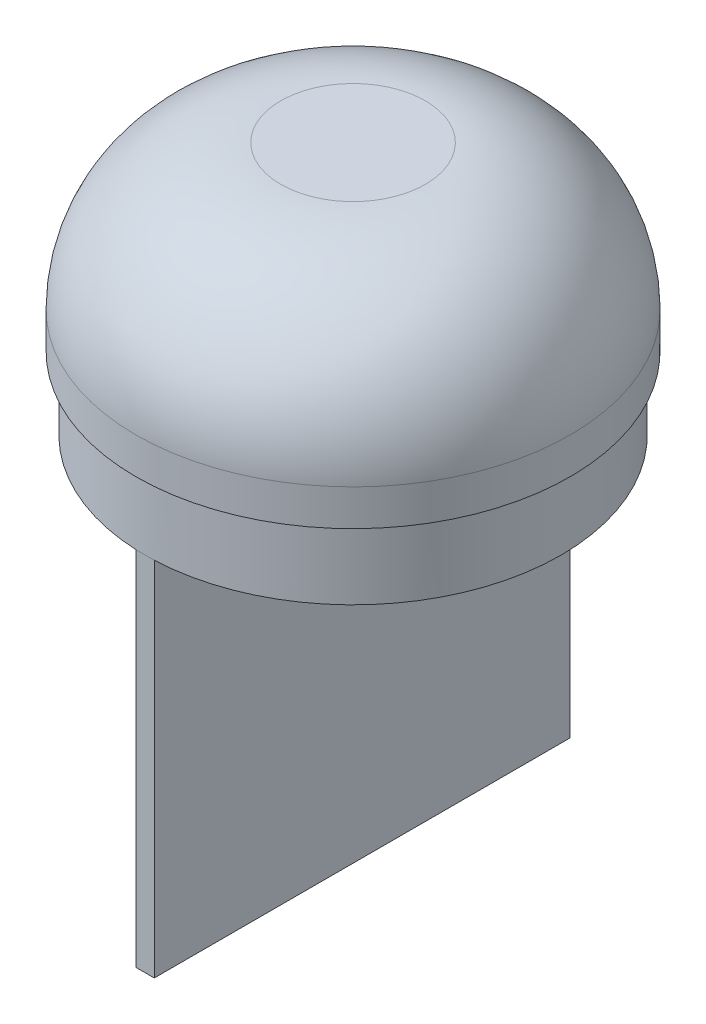
ISO-10303-21;
HEADER;
FILE_DESCRIPTION(('STEP AP214'),'2;1');
FILE_NAME('part.step','',(''),(''),'','','');
FILE_SCHEMA(('AUTOMOTIVE_DESIGN { 1 0 10303 214 1 1 1 1 }'));
ENDSEC;
DATA;
#1=APPLICATION_CONTEXT('core data for automotive mechanical design processes');
#2=APPLICATION_PROTOCOL_DEFINITION('international standard','automotive_design',2000,#1);
#3=PRODUCT_CONTEXT('',#1,'mechanical');
#4=PRODUCT('Part','Part','',(#3));
#5=PRODUCT_RELATED_PRODUCT_CATEGORY('part','',(#4));
#6=PRODUCT_DEFINITION_FORMATION('','',#4);
#7=PRODUCT_DEFINITION_CONTEXT('part definition',#1,'design');
#8=PRODUCT_DEFINITION('design','',#6,#7);
#9=PRODUCT_DEFINITION_SHAPE('','',#8);
#10=(LENGTH_UNIT() NAMED_UNIT(*) SI_UNIT(.MILLI.,.METRE.));
#11=(NAMED_UNIT(*) PLANE_ANGLE_UNIT() SI_UNIT($,.RADIAN.));
#12=(NAMED_UNIT(*) SI_UNIT($,.STERADIAN.) SOLID_ANGLE_UNIT());
#13=UNCERTAINTY_MEASURE_WITH_UNIT(LENGTH_MEASURE(1.E-05),#10,'distance_accuracy_value','');
#14=(GEOMETRIC_REPRESENTATION_CONTEXT(3) GLOBAL_UNCERTAINTY_ASSIGNED_CONTEXT((#13)) GLOBAL_UNIT_ASSIGNED_CONTEXT((#10,
#11,#12)) REPRESENTATION_CONTEXT('',''));
#15=CARTESIAN_POINT('',(0.,0.,0.));
#16=DIRECTION('',(0.,0.,1.));
#17=DIRECTION('',(1.,0.,0.));
#18=AXIS2_PLACEMENT_3D('',#15,#16,#17);
#19=CARTESIAN_POINT('',(0.,0.,0.));
#20=DIRECTION('',(0.,1.,0.));
#21=DIRECTION('',(0.,0.,1.));
#22=AXIS2_PLACEMENT_3D('',#19,#20,#21);
#23=PLANE('',#22);
#24=DIRECTION('',(0.,0.,-1.));
#25=VECTOR('',#24,1.);
#26=CARTESIAN_POINT('',(-0.25,0.,-5.74456264653803));
#27=LINE('',#26,#25);
#28=CARTESIAN_POINT('',(-0.249996391122275,0.,5.74464376945105));
#29=VERTEX_POINT('',#28);
#30=CARTESIAN_POINT('',(-0.249996839826753,0.,-5.74463390650864));
#31=VERTEX_POINT('',#30);
#32=EDGE_CURVE('E52',#29,#31,#27,.T.);
#33=ORIENTED_EDGE('',*,*,#32,.F.);
#34=CARTESIAN_POINT('',(0.,0.,0.));
#35=DIRECTION('',(0.,1.,0.));
#36=DIRECTION('',(-0.0434771856404905,0.,-0.999054420103721));
#37=AXIS2_PLACEMENT_3D('',#34,#35,#36);
#38=CIRCLE('',#37,5.75);
#39=EDGE_CURVE('E55',#31,#29,#38,.T.);
#40=ORIENTED_EDGE('',*,*,#39,.F.);
#41=EDGE_LOOP('',(#33,#40));
#42=FACE_BOUND('',#41,.T.);
#43=ADVANCED_FACE('F35',(#42),#23,.F.);
#44=DIRECTION('',(0.,0.,1.));
#45=VECTOR('',#44,1.);
#46=CARTESIAN_POINT('',(0.25,0.,-5.74456264653803));
#47=LINE('',#46,#45);
#48=CARTESIAN_POINT('',(0.249995801676083,0.,-5.74465685199978));
#49=VERTEX_POINT('',#48);
#50=CARTESIAN_POINT('',(0.249996244692889,0.,5.74464699592917));
#51=VERTEX_POINT('',#50);
#52=EDGE_CURVE('E165',#49,#51,#47,.T.);
#53=ORIENTED_EDGE('',*,*,#52,.F.);
#54=CARTESIAN_POINT('',(0.,0.,0.));
#55=DIRECTION('',(0.,1.,0.));
#56=DIRECTION('',(0.0434769867514798,0.,0.99905442875902));
#57=AXIS2_PLACEMENT_3D('',#54,#55,#56);
#58=CIRCLE('',#57,5.75);
#59=EDGE_CURVE('E119',#51,#49,#58,.T.);
#60=ORIENTED_EDGE('',*,*,#59,.F.);
#61=EDGE_LOOP('',(#53,#60));
#62=FACE_BOUND('',#61,.T.);
#63=ADVANCED_FACE('F140',(#62),#23,.F.);
#64=CARTESIAN_POINT('',(0.,2.,0.));
#65=DIRECTION('',(0.,-1.,0.));
#66=DIRECTION('',(0.,0.,-1.));
#67=AXIS2_PLACEMENT_3D('',#64,#65,#66);
#68=CYLINDRICAL_SURFACE('',#67,5.75);
#69=CARTESIAN_POINT('',(0.,2.,0.));
#70=DIRECTION('',(0.,1.,0.));
#71=DIRECTION('',(0.,0.,1.));
#72=AXIS2_PLACEMENT_3D('',#69,#70,#71);
#73=CIRCLE('',#72,5.75);
#74=CARTESIAN_POINT('',(0.,2.,5.75));
#75=VERTEX_POINT('',#74);
#76=EDGE_CURVE('E116',#75,#75,#73,.T.);
#77=ORIENTED_EDGE('',*,*,#76,.F.);
#78=EDGE_LOOP('',(#77));
#79=FACE_BOUND('',#78,.T.);
#80=ORIENTED_EDGE('',*,*,#59,.T.);
#81=CARTESIAN_POINT('',(-0.25,0.,-5.74456264653803));
#82=DIRECTION('',(1.,0.,0.));
#83=VECTOR('',#82,1.);
#84=LINE('',#81,#83);
#85=EDGE_CURVE('E158',#31,#49,#84,.T.);
#86=ORIENTED_EDGE('',*,*,#85,.F.);
#87=ORIENTED_EDGE('',*,*,#39,.T.);
#88=CARTESIAN_POINT('',(0.25,0.,5.74456264653803));
#89=DIRECTION('',(-1.,0.,0.));
#90=VECTOR('',#89,1.);
#91=LINE('',#88,#90);
#92=EDGE_CURVE('E97',#51,#29,#91,.T.);
#93=ORIENTED_EDGE('',*,*,#92,.F.);
#94=EDGE_LOOP('',(#80,#86,#87,#93));
#95=FACE_BOUND('',#94,.T.);
#96=ADVANCED_FACE('F130',(#79,#95),#68,.T.);
#97=CARTESIAN_POINT('',(0.,7.,0.));
#98=DIRECTION('',(0.,-1.,0.));
#99=DIRECTION('',(0.,0.,-1.));
#100=AXIS2_PLACEMENT_3D('',#97,#98,#99);
#101=CYLINDRICAL_SURFACE('',#100,6.);
#102=CARTESIAN_POINT('',(0.,3.,0.));
#103=DIRECTION('',(0.,1.,0.));
#104=DIRECTION('',(0.,0.,1.));
#105=AXIS2_PLACEMENT_3D('',#102,#103,#104);
#106=CIRCLE('',#105,6.);
#107=CARTESIAN_POINT('',(0.,3.,6.));
#108=VERTEX_POINT('',#107);
#109=EDGE_CURVE('E11',#108,#108,#106,.F.);
#110=ORIENTED_EDGE('',*,*,#109,.T.);
#111=EDGE_LOOP('',(#110));
#112=FACE_BOUND('',#111,.T.);
#113=CARTESIAN_POINT('',(0.,2.,0.));
#114=DIRECTION('',(0.,1.,0.));
#115=DIRECTION('',(0.,0.,1.));
#116=AXIS2_PLACEMENT_3D('',#113,#114,#115);
#117=CIRCLE('',#116,6.);
#118=CARTESIAN_POINT('',(0.,2.,6.));
#119=VERTEX_POINT('',#118);
#120=EDGE_CURVE('E100',#119,#119,#117,.T.);
#121=ORIENTED_EDGE('',*,*,#120,.T.);
#122=EDGE_LOOP('',(#121));
#123=FACE_BOUND('',#122,.T.);
#124=ADVANCED_FACE('F139',(#112,#123),#101,.T.);
#125=CARTESIAN_POINT('',(0.,7.,0.));
#126=DIRECTION('',(0.,1.,0.));
#127=DIRECTION('',(0.,0.,1.));
#128=AXIS2_PLACEMENT_3D('',#125,#126,#127);
#129=PLANE('',#128);
#130=CARTESIAN_POINT('',(0.,7.,0.));
#131=DIRECTION('',(0.,1.,0.));
#132=DIRECTION('',(0.,0.,1.));
#133=AXIS2_PLACEMENT_3D('',#130,#131,#132);
#134=CIRCLE('',#133,2.);
#135=CARTESIAN_POINT('',(0.,7.,2.));
#136=VERTEX_POINT('',#135);
#137=EDGE_CURVE('E45',#136,#136,#134,.T.);
#138=ORIENTED_EDGE('',*,*,#137,.T.);
#139=EDGE_LOOP('',(#138));
#140=FACE_BOUND('',#139,.T.);
#141=ADVANCED_FACE('F202',(#140),#129,.T.);
#142=CARTESIAN_POINT('',(0.,2.,0.));
#143=DIRECTION('',(0.,1.,0.));
#144=DIRECTION('',(0.,0.,1.));
#145=AXIS2_PLACEMENT_3D('',#142,#143,#144);
#146=PLANE('',#145);
#147=ORIENTED_EDGE('',*,*,#76,.T.);
#148=EDGE_LOOP('',(#147));
#149=FACE_BOUND('',#148,.T.);
#150=ORIENTED_EDGE('',*,*,#120,.F.);
#151=EDGE_LOOP('',(#150));
#152=FACE_BOUND('',#151,.T.);
#153=ADVANCED_FACE('F204',(#149,#152),#146,.F.);
#154=CARTESIAN_POINT('',(0.,3.,0.));
#155=DIRECTION('',(0.,1.,0.));
#156=DIRECTION('',(0.,0.,1.));
#157=AXIS2_PLACEMENT_3D('',#154,#155,#156);
#158=DEGENERATE_TOROIDAL_SURFACE('',#157,2.,4.,.T.);
#159=ORIENTED_EDGE('',*,*,#109,.F.);
#160=EDGE_LOOP('',(#159));
#161=FACE_BOUND('',#160,.T.);
#162=ORIENTED_EDGE('',*,*,#137,.F.);
#163=EDGE_LOOP('',(#162));
#164=FACE_BOUND('',#163,.T.);
#165=ADVANCED_FACE('F37',(#161,#164),#158,.T.);
#166=CARTESIAN_POINT('',(-0.25,-10.,-5.74456264653803));
#167=DIRECTION('',(1.,0.,0.));
#168=DIRECTION('',(0.,0.,-1.));
#169=AXIS2_PLACEMENT_3D('',#166,#167,#168);
#170=PLANE('',#169);
#171=ORIENTED_EDGE('',*,*,#32,.T.);
#172=DIRECTION('',(0.,1.,0.));
#173=VECTOR('',#172,1.);
#174=CARTESIAN_POINT('',(-0.25,-10.,-5.74456264653803));
#175=LINE('',#174,#173);
#176=CARTESIAN_POINT('',(-0.25,-10.,-5.74456264653803));
#177=VERTEX_POINT('',#176);
#178=EDGE_CURVE('E82',#177,#31,#175,.T.);
#179=ORIENTED_EDGE('',*,*,#178,.F.);
#180=DIRECTION('',(0.,0.,-1.));
#181=VECTOR('',#180,1.);
#182=CARTESIAN_POINT('',(-0.25,-10.,-5.74456264653803));
#183=LINE('',#182,#181);
#184=CARTESIAN_POINT('',(-0.25,-10.,5.74456264653803));
#185=VERTEX_POINT('',#184);
#186=EDGE_CURVE('E88',#185,#177,#183,.T.);
#187=ORIENTED_EDGE('',*,*,#186,.F.);
#188=DIRECTION('',(0.,1.,0.));
#189=VECTOR('',#188,1.);
#190=CARTESIAN_POINT('',(-0.25,-10.,5.74456264653803));
#191=LINE('',#190,#189);
#192=EDGE_CURVE('E163',#185,#29,#191,.T.);
#193=ORIENTED_EDGE('',*,*,#192,.T.);
#194=EDGE_LOOP('',(#171,#179,#187,#193));
#195=FACE_BOUND('',#194,.T.);
#196=ADVANCED_FACE('F99',(#195),#170,.F.);
#197=CARTESIAN_POINT('',(-0.25,-10.,-5.74456264653803));
#198=DIRECTION('',(0.,0.,1.));
#199=DIRECTION('',(1.,0.,0.));
#200=AXIS2_PLACEMENT_3D('',#197,#198,#199);
#201=PLANE('',#200);
#202=ORIENTED_EDGE('',*,*,#85,.T.);
#203=DIRECTION('',(0.,1.,0.));
#204=VECTOR('',#203,1.);
#205=CARTESIAN_POINT('',(0.25,-10.,-5.74456264653803));
#206=LINE('',#205,#204);
#207=CARTESIAN_POINT('',(0.25,-10.,-5.74456264653803));
#208=VERTEX_POINT('',#207);
#209=EDGE_CURVE('E84',#208,#49,#206,.T.);
#210=ORIENTED_EDGE('',*,*,#209,.F.);
#211=DIRECTION('',(1.,0.,0.));
#212=VECTOR('',#211,1.);
#213=CARTESIAN_POINT('',(-0.25,-10.,-5.74456264653803));
#214=LINE('',#213,#212);
#215=EDGE_CURVE('E77',#177,#208,#214,.T.);
#216=ORIENTED_EDGE('',*,*,#215,.F.);
#217=ORIENTED_EDGE('',*,*,#178,.T.);
#218=EDGE_LOOP('',(#202,#210,#216,#217));
#219=FACE_BOUND('',#218,.T.);
#220=ADVANCED_FACE('F80',(#219),#201,.F.);
#221=CARTESIAN_POINT('',(0.25,-10.,-5.74456264653803));
#222=DIRECTION('',(-1.,0.,0.));
#223=DIRECTION('',(0.,0.,1.));
#224=AXIS2_PLACEMENT_3D('',#221,#222,#223);
#225=PLANE('',#224);
#226=ORIENTED_EDGE('',*,*,#52,.T.);
#227=DIRECTION('',(0.,1.,0.));
#228=VECTOR('',#227,1.);
#229=CARTESIAN_POINT('',(0.25,-10.,5.74456264653803));
#230=LINE('',#229,#228);
#231=CARTESIAN_POINT('',(0.25,-10.,5.74456264653803));
#232=VERTEX_POINT('',#231);
#233=EDGE_CURVE('E104',#232,#51,#230,.T.);
#234=ORIENTED_EDGE('',*,*,#233,.F.);
#235=DIRECTION('',(0.,0.,1.));
#236=VECTOR('',#235,1.);
#237=CARTESIAN_POINT('',(0.25,-10.,-5.74456264653803));
#238=LINE('',#237,#236);
#239=EDGE_CURVE('E87',#208,#232,#238,.T.);
#240=ORIENTED_EDGE('',*,*,#239,.F.);
#241=ORIENTED_EDGE('',*,*,#209,.T.);
#242=EDGE_LOOP('',(#226,#234,#240,#241));
#243=FACE_BOUND('',#242,.T.);
#244=ADVANCED_FACE('F178',(#243),#225,.F.);
#245=CARTESIAN_POINT('',(-0.25,-10.,5.74456264653803));
#246=DIRECTION('',(0.,0.,-1.));
#247=DIRECTION('',(-1.,0.,0.));
#248=AXIS2_PLACEMENT_3D('',#245,#246,#247);
#249=PLANE('',#248);
#250=ORIENTED_EDGE('',*,*,#92,.T.);
#251=ORIENTED_EDGE('',*,*,#192,.F.);
#252=DIRECTION('',(-1.,0.,0.));
#253=VECTOR('',#252,1.);
#254=CARTESIAN_POINT('',(-0.25,-10.,5.74456264653803));
#255=LINE('',#254,#253);
#256=EDGE_CURVE('E93',#232,#185,#255,.T.);
#257=ORIENTED_EDGE('',*,*,#256,.F.);
#258=ORIENTED_EDGE('',*,*,#233,.T.);
#259=EDGE_LOOP('',(#250,#251,#257,#258));
#260=FACE_BOUND('',#259,.T.);
#261=ADVANCED_FACE('F162',(#260),#249,.F.);
#262=CARTESIAN_POINT('',(0.,-10.,0.));
#263=DIRECTION('',(0.,1.,0.));
#264=DIRECTION('',(0.,0.,1.));
#265=AXIS2_PLACEMENT_3D('',#262,#263,#264);
#266=PLANE('',#265);
#267=ORIENTED_EDGE('',*,*,#186,.T.);
#268=ORIENTED_EDGE('',*,*,#215,.T.);
#269=ORIENTED_EDGE('',*,*,#239,.T.);
#270=ORIENTED_EDGE('',*,*,#256,.T.);
#271=EDGE_LOOP('',(#267,#268,#269,#270));
#272=FACE_BOUND('',#271,.T.);
#273=ADVANCED_FACE('F91',(#272),#266,.F.);
#274=CLOSED_SHELL('',(#43,#63,#96,#124,#141,#153,#165,#196,#220,#244,#261,#273));
#275=MANIFOLD_SOLID_BREP('B2',#274);
#276=ADVANCED_BREP_SHAPE_REPRESENTATION('',(#18,#275),#14);
#277=SHAPE_DEFINITION_REPRESENTATION(#9,#276);
ENDSEC;
END-ISO-10303-21;
